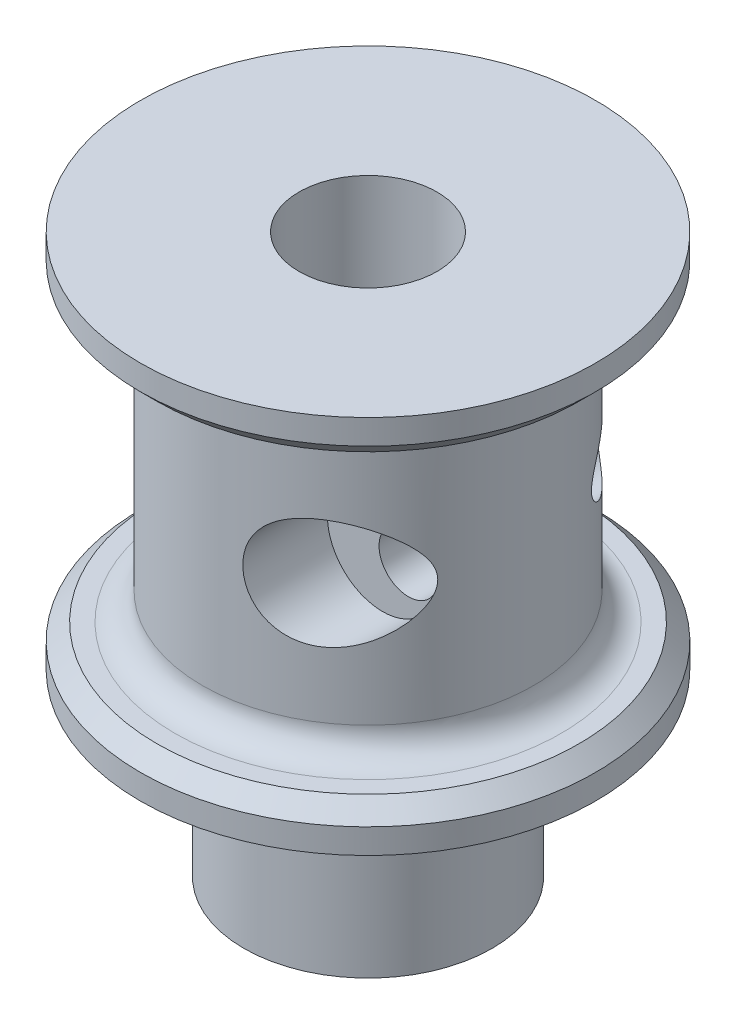
ISO-10303-21;
HEADER;
FILE_DESCRIPTION(('STEP AP214'),'2;1');
FILE_NAME('part.step','',(''),(''),'','','');
FILE_SCHEMA(('AUTOMOTIVE_DESIGN { 1 0 10303 214 1 1 1 1 }'));
ENDSEC;
DATA;
#1=APPLICATION_CONTEXT('core data for automotive mechanical design processes');
#2=APPLICATION_PROTOCOL_DEFINITION('international standard','automotive_design',2000,#1);
#3=PRODUCT_CONTEXT('',#1,'mechanical');
#4=PRODUCT('Part','Part','',(#3));
#5=PRODUCT_RELATED_PRODUCT_CATEGORY('part','',(#4));
#6=PRODUCT_DEFINITION_FORMATION('','',#4);
#7=PRODUCT_DEFINITION_CONTEXT('part definition',#1,'design');
#8=PRODUCT_DEFINITION('design','',#6,#7);
#9=PRODUCT_DEFINITION_SHAPE('','',#8);
#10=(LENGTH_UNIT() NAMED_UNIT(*) SI_UNIT(.MILLI.,.METRE.));
#11=(NAMED_UNIT(*) PLANE_ANGLE_UNIT() SI_UNIT($,.RADIAN.));
#12=(NAMED_UNIT(*) SI_UNIT($,.STERADIAN.) SOLID_ANGLE_UNIT());
#13=UNCERTAINTY_MEASURE_WITH_UNIT(LENGTH_MEASURE(1.E-05),#10,'distance_accuracy_value','');
#14=(GEOMETRIC_REPRESENTATION_CONTEXT(3) GLOBAL_UNCERTAINTY_ASSIGNED_CONTEXT((#13)) GLOBAL_UNIT_ASSIGNED_CONTEXT((#10,
#11,#12)) REPRESENTATION_CONTEXT('',''));
#15=CARTESIAN_POINT('',(0.,0.,0.));
#16=DIRECTION('',(0.,0.,1.));
#17=DIRECTION('',(1.,0.,0.));
#18=AXIS2_PLACEMENT_3D('',#15,#16,#17);
#19=CARTESIAN_POINT('',(0.,64.29375,0.));
#20=DIRECTION('',(0.,1.,0.));
#21=DIRECTION('',(0.,0.,1.));
#22=AXIS2_PLACEMENT_3D('',#19,#20,#21);
#23=CYLINDRICAL_SURFACE('',#22,19.05);
#24=CARTESIAN_POINT('',(0.,28.575,0.));
#25=DIRECTION('',(0.,-1.,0.));
#26=DIRECTION('',(0.,0.,-1.));
#27=AXIS2_PLACEMENT_3D('',#24,#25,#26);
#28=CIRCLE('',#27,19.05);
#29=CARTESIAN_POINT('',(0.,28.575,-19.05));
#30=VERTEX_POINT('',#29);
#31=EDGE_CURVE('E98',#30,#30,#28,.F.);
#32=ORIENTED_EDGE('',*,*,#31,.T.);
#33=EDGE_LOOP('',(#32));
#34=FACE_BOUND('',#33,.T.);
#35=CARTESIAN_POINT('',(0.,56.35625,0.));
#36=DIRECTION('',(0.,1.,0.));
#37=DIRECTION('',(0.,0.,1.));
#38=AXIS2_PLACEMENT_3D('',#35,#36,#37);
#39=CIRCLE('',#38,19.05);
#40=CARTESIAN_POINT('',(0.,56.35625,19.05));
#41=VERTEX_POINT('',#40);
#42=EDGE_CURVE('E95',#41,#41,#39,.F.);
#43=ORIENTED_EDGE('',*,*,#42,.T.);
#44=EDGE_LOOP('',(#43));
#45=FACE_BOUND('',#44,.T.);
#46=CARTESIAN_POINT('',(16.87195,42.465625,-8.84532663034554));
#47=CARTESIAN_POINT('',(16.8719465216361,42.5628249372381,-8.84533418626981));
#48=CARTESIAN_POINT('',(16.8677093521176,42.6600525129128,-8.85342965716035));
#49=CARTESIAN_POINT('',(16.8512362092056,42.8513541307299,-8.8847413356337));
#50=CARTESIAN_POINT('',(16.8389891828751,42.9454236261281,-8.90797843724561));
#51=CARTESIAN_POINT('',(16.803253060049,43.1537384219589,-8.97524311057987));
#52=CARTESIAN_POINT('',(16.7775812245768,43.2662938089759,-9.02326157613072));
#53=CARTESIAN_POINT('',(16.7175633506835,43.4814097097343,-9.13397636915276));
#54=CARTESIAN_POINT('',(16.6831969411713,43.5839459558198,-9.1967071415093));
#55=CARTESIAN_POINT('',(16.613644835805,43.7642058524494,-9.32167464136595));
#56=CARTESIAN_POINT('',(16.5794084983376,43.8433140114177,-9.38248626346868));
#57=CARTESIAN_POINT('',(16.5069598638681,43.9952965911593,-9.50936988179796));
#58=CARTESIAN_POINT('',(16.468744725659,44.0681664886704,-9.5754456290478));
#59=CARTESIAN_POINT('',(16.3888546750002,44.2083598835788,-9.7115489958235));
#60=CARTESIAN_POINT('',(16.3471731992896,44.2756723552871,-9.78158402785889));
#61=CARTESIAN_POINT('',(16.2607954732451,44.4051473347608,-9.92451601918506));
#62=CARTESIAN_POINT('',(16.2160981697433,44.467308026392,-9.99741397449423));
#63=CARTESIAN_POINT('',(16.0873568219779,44.6344568823733,-10.2041091493854));
#64=CARTESIAN_POINT('',(16.0002749338024,44.7342181332729,-10.3402600896236));
#65=CARTESIAN_POINT('',(15.8183218174806,44.9203193991438,-10.6165264217246));
#66=CARTESIAN_POINT('',(15.7234449777685,45.0066496134602,-10.7566446211991));
#67=CARTESIAN_POINT('',(15.5264084093469,45.1668598773862,-11.039150003444));
#68=CARTESIAN_POINT('',(15.424240116774,45.2407249324081,-11.1815396965424));
#69=CARTESIAN_POINT('',(15.2131683101731,45.3762184676025,-11.4670630170034));
#70=CARTESIAN_POINT('',(15.1042665401337,45.4378500989971,-11.6101964430132));
#71=CARTESIAN_POINT('',(14.8743632675527,45.5516276371218,-11.9034557336424));
#72=CARTESIAN_POINT('',(14.753028309409,45.6031352277091,-12.0535686854164));
#73=CARTESIAN_POINT('',(14.5036786862621,45.692047563634,-12.3524776100308));
#74=CARTESIAN_POINT('',(14.375662772275,45.7294496611649,-12.5012733304937));
#75=CARTESIAN_POINT('',(14.1137113791278,45.789160589946,-12.7962672753531));
#76=CARTESIAN_POINT('',(13.9797862121799,45.8114946865352,-12.942469445574));
#77=CARTESIAN_POINT('',(13.7066832042678,45.8399028347601,-13.2313612100489));
#78=CARTESIAN_POINT('',(13.5675074297327,45.8459832168858,-13.3740521503946));
#79=CARTESIAN_POINT('',(13.2214786455279,45.8390442951247,-13.7177897137062));
#80=CARTESIAN_POINT('',(13.0121828517401,45.8162723575563,-13.9164099442979));
#81=CARTESIAN_POINT('',(12.6956518392678,45.7499640148885,-14.2036399502211));
#82=CARTESIAN_POINT('',(12.5897233587205,45.7225081362489,-14.2975890892678));
#83=CARTESIAN_POINT('',(12.3778916826161,45.6561448845651,-14.4813650119207));
#84=CARTESIAN_POINT('',(12.2719884866214,45.6172400312108,-14.5711926975532));
#85=CARTESIAN_POINT('',(11.9998574550757,45.5009805071538,-14.7970509454557));
#86=CARTESIAN_POINT('',(11.8344335368793,45.4144305035841,-14.9295068717589));
#87=CARTESIAN_POINT('',(11.5126547664411,45.20859810758,-15.1790212855659));
#88=CARTESIAN_POINT('',(11.3562895585975,45.089354021439,-15.2960975567827));
#89=CARTESIAN_POINT('',(11.0850456013547,44.8401433818786,-15.4934685972486));
#90=CARTESIAN_POINT('',(10.9676015390035,44.7153027352788,-15.5766402895676));
#91=CARTESIAN_POINT('',(10.804181322348,44.5116130546891,-15.6900159212121));
#92=CARTESIAN_POINT('',(10.7518120516881,44.44094375616,-15.7259240686357));
#93=CARTESIAN_POINT('',(10.65198676232,44.294412188179,-15.7937110234648));
#94=CARTESIAN_POINT('',(10.6045286552496,44.2185521489589,-15.825591544812));
#95=CARTESIAN_POINT('',(10.5148920656911,44.0615165846766,-15.8852909500259));
#96=CARTESIAN_POINT('',(10.4727501345968,43.9803095462753,-15.9130819126753));
#97=CARTESIAN_POINT('',(10.3947720870703,43.8135988260272,-15.9641280707968));
#98=CARTESIAN_POINT('',(10.3589329818757,43.7280972055086,-15.9873854166532));
#99=CARTESIAN_POINT('',(10.2941240983516,43.5534238121014,-16.0291920587799));
#100=CARTESIAN_POINT('',(10.2651535716581,43.464252440293,-16.0477418679739));
#101=CARTESIAN_POINT('',(10.2145741455836,43.2829933957121,-16.0799837382553));
#102=CARTESIAN_POINT('',(10.1929643826478,43.1909060664223,-16.0936763691881));
#103=CARTESIAN_POINT('',(10.1594149216312,43.0147928130937,-16.1148731515233));
#104=CARTESIAN_POINT('',(10.1466793419063,42.9309788817346,-16.1228882543498));
#105=CARTESIAN_POINT('',(10.1275331279578,42.7623154073923,-16.1349217880104));
#106=CARTESIAN_POINT('',(10.1211246600631,42.6774655197695,-16.1389388499661));
#107=CARTESIAN_POINT('',(10.1147402584881,42.5074864646841,-16.1429410693307));
#108=CARTESIAN_POINT('',(10.1147596032331,42.4223575481495,-16.1429291862167));
#109=CARTESIAN_POINT('',(10.1212096112478,42.2524299339242,-16.1388853530222));
#110=CARTESIAN_POINT('',(10.1276426065808,42.1676313676113,-16.1348519406759));
#111=CARTESIAN_POINT('',(10.1554794057188,41.9233980902408,-16.1173593190421));
#112=CARTESIAN_POINT('',(10.1851326275399,41.7651689530766,-16.0986926292657));
#113=CARTESIAN_POINT('',(10.2657689978618,41.4567470690068,-16.0473899126782));
#114=CARTESIAN_POINT('',(10.3167518731244,41.3065542191821,-16.0147540648153));
#115=CARTESIAN_POINT('',(10.4389479692678,41.014404671499,-15.9353777891988));
#116=CARTESIAN_POINT('',(10.5105932886836,40.8727116054846,-15.8883346098704));
#117=CARTESIAN_POINT('',(10.6703009539847,40.6042265155821,-15.7815204437432));
#118=CARTESIAN_POINT('',(10.7583672533064,40.4774380920745,-15.7217463914266));
#119=CARTESIAN_POINT('',(10.955731385411,40.230027147831,-15.58493044184));
#120=CARTESIAN_POINT('',(11.066218693977,40.1109445775826,-15.5068282183549));
#121=CARTESIAN_POINT('',(11.2979595224625,39.8934568648519,-15.3388121993985));
#122=CARTESIAN_POINT('',(11.4192196466462,39.7950645326758,-15.2488911419821));
#123=CARTESIAN_POINT('',(11.7202752585022,39.5822872575235,-15.0195386233509));
#124=CARTESIAN_POINT('',(11.9034960843694,39.4781841811654,-14.8750367473259));
#125=CARTESIAN_POINT('',(12.2746758463006,39.3084244751125,-14.5702685273069));
#126=CARTESIAN_POINT('',(12.4626426171761,39.2428364341405,-14.4099746494669));
#127=CARTESIAN_POINT('',(12.7734070063865,39.1626463080341,-14.1340055546029));
#128=CARTESIAN_POINT('',(12.8967355817023,39.1383016427339,-14.0215846400365));
#129=CARTESIAN_POINT('',(13.1414594277856,39.1035716302142,-13.7924837539681));
#130=CARTESIAN_POINT('',(13.2628540855537,39.0931906253986,-13.6758024691621));
#131=CARTESIAN_POINT('',(13.502850132941,39.0853008545946,-13.4388997751098));
#132=CARTESIAN_POINT('',(13.6214474444919,39.0878098397898,-13.3186737107514));
#133=CARTESIAN_POINT('',(13.8549769801614,39.104753799575,-13.0755699957117));
#134=CARTESIAN_POINT('',(13.9699092357981,39.1191886715784,-12.952692367848));
#135=CARTESIAN_POINT('',(14.225496223059,39.1644429790262,-12.6721211735543));
#136=CARTESIAN_POINT('',(14.3649043165988,39.1985886413531,-12.5138235557884));
#137=CARTESIAN_POINT('',(14.6363305876669,39.2833348276302,-12.1952511749152));
#138=CARTESIAN_POINT('',(14.7683459414171,39.3339415895893,-12.0349756844707));
#139=CARTESIAN_POINT('',(15.0244138193233,39.4508087043639,-11.7137393511001));
#140=CARTESIAN_POINT('',(15.1484650028052,39.517071683978,-11.5527783976221));
#141=CARTESIAN_POINT('',(15.3880536035669,39.6649689879374,-11.2316687418407));
#142=CARTESIAN_POINT('',(15.5035949139057,39.7465962219757,-11.0715196997257));
#143=CARTESIAN_POINT('',(15.6858316591511,39.8935877746442,-10.8107666949455));
#144=CARTESIAN_POINT('',(15.7551969350105,39.9543016597317,-10.7093851624812));
#145=CARTESIAN_POINT('',(15.8899846363061,40.0825695909406,-10.5083546635872));
#146=CARTESIAN_POINT('',(15.9554078798866,40.1501222098708,-10.4087053407242));
#147=CARTESIAN_POINT('',(16.0819076073571,40.2924415099106,-10.2121679782273));
#148=CARTESIAN_POINT('',(16.1429921169525,40.3671942348956,-10.1152750501221));
#149=CARTESIAN_POINT('',(16.260482237279,40.5247287454101,-9.92530502625232));
#150=CARTESIAN_POINT('',(16.3168901827343,40.6075064792134,-9.83222603830212));
#151=CARTESIAN_POINT('',(16.4313476044249,40.7934427730511,-9.63988478941781));
#152=CARTESIAN_POINT('',(16.4886654424024,40.8978525889301,-9.54138032176987));
#153=CARTESIAN_POINT('',(16.5948878393044,41.1201388626404,-9.35540518135589));
#154=CARTESIAN_POINT('',(16.6437997296774,41.2380034347042,-9.26792491151947));
#155=CARTESIAN_POINT('',(16.7190192353771,41.455954723619,-9.13133698015377));
#156=CARTESIAN_POINT('',(16.747889660634,41.5525796889313,-9.07818561837451));
#157=CARTESIAN_POINT('',(16.7977803305776,41.7540634083485,-8.98553561533661));
#158=CARTESIAN_POINT('',(16.8188180265392,41.8589032207732,-8.94600663829486));
#159=CARTESIAN_POINT('',(16.8469702792428,42.047561134364,-8.89284893107602));
#160=CARTESIAN_POINT('',(16.8562689520402,42.1299052869696,-8.87518296958726));
#161=CARTESIAN_POINT('',(16.8687585285421,42.2967018477084,-8.85142193711176));
#162=CARTESIAN_POINT('',(16.8719530228868,42.3811529868178,-8.84532006383787));
#163=CARTESIAN_POINT('',(16.87195,42.465625,-8.84532663034554));
#164=B_SPLINE_CURVE_WITH_KNOTS('',3,(#46,#47,#48,#49,#50,#51,#52,#53,#54,#55,#56,#57,#58,#59,
#60,#61,#62,#63,#64,#65,#66,#67,#68,#69,#70,#71,#72,#73,#74,#75,#76,#77,#78,#79,#80,#81,#82,#83,
#84,#85,#86,#87,#88,#89,#90,#91,#92,#93,#94,#95,#96,#97,#98,#99,#100,#101,#102,#103,#104,#105,
#106,#107,#108,#109,#110,#111,#112,#113,#114,#115,#116,#117,#118,#119,#120,#121,#122,#123,#124,
#125,#126,#127,#128,#129,#130,#131,#132,#133,#134,#135,#136,#137,#138,#139,#140,#141,#142,#143,
#144,#145,#146,#147,#148,#149,#150,#151,#152,#153,#154,#155,#156,#157,#158,#159,#160,#161,#162,
#163),.UNSPECIFIED.,.T.,.F.,(4,2,2,2,2,2,2,2,2,2,2,2,2,2,2,2,2,2,2,2,2,2,2,2,2,2,2,2,2,2,2,2,2,
2,2,2,2,2,2,2,2,2,2,2,2,2,2,2,2,2,2,2,2,2,2,2,2,2,4),(0.,0.291250071262371,0.582902893810931,
0.955895250123374,1.32976974161812,1.6458007963426,1.96205909276198,2.27893046473695,
2.59591307099201,3.16482689726047,3.73415393344555,4.3041610167205,4.87402108010225,
5.47273560689547,6.07156246526517,6.66938272578152,7.26697011356522,8.13168293535657,
8.56393392036089,8.99608984663929,9.68004103514791,10.3631942660223,10.9321304646758,
11.2168485381084,11.5014450397385,11.7879024547183,12.0742236648768,12.3605136646455,
12.6467700656804,12.9019057981855,13.1571288559088,13.4121644389567,13.6672927891587,
14.1510224554962,14.6347459253278,15.1294267188311,15.6242267634445,16.1628378729712,
16.7017814866013,17.4641664732488,18.2279050524883,18.7332270929899,19.2387062416834,
19.7448816869871,20.2510527782074,20.8912437192485,21.531677546767,22.1722189026068,
22.8124653824945,23.2233384996657,23.6341260468488,24.044132792985,24.4539335993859,
24.9167479965324,25.379156667596,25.720111448149,26.0603019719624,26.3135630889469,
26.5666751850864),.UNSPECIFIED.);
#165=CARTESIAN_POINT('',(16.87195,42.465625,-8.84532663034554));
#166=VERTEX_POINT('',#165);
#167=EDGE_CURVE('E58',#166,#166,#164,.T.);
#168=ORIENTED_EDGE('',*,*,#167,.T.);
#169=EDGE_LOOP('',(#168));
#170=FACE_BOUND('',#169,.T.);
#171=CARTESIAN_POINT('',(4.17195,42.465625,18.5875585593563));
#172=CARTESIAN_POINT('',(4.17195021808428,42.2919228529711,18.5875586178116));
#173=CARTESIAN_POINT('',(4.17908239864553,42.1182167173892,18.5859620418283));
#174=CARTESIAN_POINT('',(4.20756066508708,41.7719536232744,18.5795356424714));
#175=CARTESIAN_POINT('',(4.22891341051034,41.599397241433,18.5747043042412));
#176=CARTESIAN_POINT('',(4.28566903104535,41.2567138427395,18.5616913992418));
#177=CARTESIAN_POINT('',(4.32107380419929,41.0865871572897,18.5535093798832));
#178=CARTESIAN_POINT('',(4.4056213837091,40.7500763398786,18.5336149505616));
#179=CARTESIAN_POINT('',(4.45475786574346,40.5836905230356,18.5219041656249));
#180=CARTESIAN_POINT('',(4.56639574739873,40.2556687981284,18.4946973462098));
#181=CARTESIAN_POINT('',(4.62890523617927,40.0940358326131,18.4791990198851));
#182=CARTESIAN_POINT('',(4.76670528265085,39.7768434134291,18.4441337520353));
#183=CARTESIAN_POINT('',(4.84199101236233,39.621281692726,18.4245683467819));
#184=CARTESIAN_POINT('',(5.00471208814968,39.3172409152068,18.3810350044571));
#185=CARTESIAN_POINT('',(5.09215045196683,39.1687636299368,18.3570659734003));
#186=CARTESIAN_POINT('',(5.27832964298539,38.8800371305056,18.3044007540702));
#187=CARTESIAN_POINT('',(5.37706624577975,38.7397848704857,18.2757063308682));
#188=CARTESIAN_POINT('',(5.58455582513596,38.4689220142496,18.2133720594647));
#189=CARTESIAN_POINT('',(5.69327009778455,38.3382774306236,18.1797510421073));
#190=CARTESIAN_POINT('',(5.91999331097417,38.0869104085435,18.1071903142523));
#191=CARTESIAN_POINT('',(6.03800218811788,37.9661879024236,18.0682506400312));
#192=CARTESIAN_POINT('',(6.28217165491967,37.735403277312,17.9848118717485));
#193=CARTESIAN_POINT('',(6.40833155558242,37.625340259248,17.9403132472816));
#194=CARTESIAN_POINT('',(6.66760021699704,37.416446543648,17.8455779429559));
#195=CARTESIAN_POINT('',(6.80070902416961,37.3176159211615,17.7953412247623));
#196=CARTESIAN_POINT('',(7.07356906970298,37.1309567933065,17.6886609222176));
#197=CARTESIAN_POINT('',(7.21336041629441,37.043210491918,17.6321761975283));
#198=CARTESIAN_POINT('',(7.49746343770359,36.8797632335889,17.5132596589294));
#199=CARTESIAN_POINT('',(7.64177698104534,36.8040673364333,17.4508253643811));
#200=CARTESIAN_POINT('',(7.93355623716911,36.664862769516,17.3201250848558));
#201=CARTESIAN_POINT('',(8.0810213425497,36.601351774481,17.2518602161415));
#202=CARTESIAN_POINT('',(8.37791397589429,36.486414832932,17.1096509291039));
#203=CARTESIAN_POINT('',(8.52734168348279,36.4349900008414,17.0357059878742));
#204=CARTESIAN_POINT('',(8.83598132608253,36.3412840309509,16.8777885942093));
#205=CARTESIAN_POINT('',(8.99524357642449,36.2997343807689,16.793480865165));
#206=CARTESIAN_POINT('',(9.31345026769507,36.2295541902694,16.6191175031538));
#207=CARTESIAN_POINT('',(9.47239470363205,36.2009238513018,16.5290617806283));
#208=CARTESIAN_POINT('',(9.78898001906057,36.1560427232328,16.3435627540579));
#209=CARTESIAN_POINT('',(9.9466201869439,36.1397983012962,16.2481167060768));
#210=CARTESIAN_POINT('',(10.2596184678381,36.1191068693275,16.0523154804189));
#211=CARTESIAN_POINT('',(10.4149761742182,36.1146619366781,15.9519594414707));
#212=CARTESIAN_POINT('',(10.7836851199541,36.11738462494,15.7060901191539));
#213=CARTESIAN_POINT('',(10.9955973391326,36.1298575845266,15.5584541086855));
#214=CARTESIAN_POINT('',(11.411875311752,36.1748065883899,15.2557499122182));
#215=CARTESIAN_POINT('',(11.6162385330652,36.2072892810124,15.1006792718204));
#216=CARTESIAN_POINT('',(12.0164461655695,36.2906106543418,14.784203428424));
#217=CARTESIAN_POINT('',(12.21228141012,36.3414685660332,14.6227917473973));
#218=CARTESIAN_POINT('',(12.5943985906113,36.4600045742915,14.2949990973338));
#219=CARTESIAN_POINT('',(12.7806812881039,36.5276813274976,14.1286185261074));
#220=CARTESIAN_POINT('',(13.1457305154086,36.679615153489,13.7896762463482));
#221=CARTESIAN_POINT('',(13.3243557087869,36.7640906229326,13.6170606606622));
#222=CARTESIAN_POINT('',(13.670935171061,36.9479371849234,13.2690746196905));
#223=CARTESIAN_POINT('',(13.8388887727297,37.0473092075556,13.0937039930029));
#224=CARTESIAN_POINT('',(14.1640053933669,37.2602691000942,12.741309425922));
#225=CARTESIAN_POINT('',(14.3211598785709,37.3738680168925,12.5642843007765));
#226=CARTESIAN_POINT('',(14.6243252622821,37.6147992067687,12.2100752260926));
#227=CARTESIAN_POINT('',(14.7703373206123,37.7421300471424,12.0328912950322));
#228=CARTESIAN_POINT('',(15.0416415370662,38.0015761853056,11.6916981123554));
#229=CARTESIAN_POINT('',(15.1676660852924,38.1328065017183,11.5275980822336));
#230=CARTESIAN_POINT('',(15.4095692179672,38.4076438936616,11.2021771301595));
#231=CARTESIAN_POINT('',(15.5254451923001,38.5512541344551,11.0408569316724));
#232=CARTESIAN_POINT('',(15.7462882730323,38.8512892885426,10.7235333963683));
#233=CARTESIAN_POINT('',(15.8512795229969,39.0076844016603,10.5675188314632));
#234=CARTESIAN_POINT('',(16.0497754492597,39.3347731519929,10.2635323119011));
#235=CARTESIAN_POINT('',(16.1432889606709,39.505455618952,10.1155542206288));
#236=CARTESIAN_POINT('',(16.3157934925468,39.8595007296541,9.83483370388366));
#237=CARTESIAN_POINT('',(16.3950377941567,40.0425410684003,9.70184555180777));
#238=CARTESIAN_POINT('',(16.5390120653331,40.426160740454,9.45431168401019));
#239=CARTESIAN_POINT('',(16.6037529226522,40.6267267589142,9.33975215223973));
#240=CARTESIAN_POINT('',(16.7053046904144,41.0094579433332,9.15665440072944));
#241=CARTESIAN_POINT('',(16.7450322738949,41.1885824133716,9.08355798703743));
#242=CARTESIAN_POINT('',(16.7933950596589,41.4654898248869,8.99363894141309));
#243=CARTESIAN_POINT('',(16.8076419190501,41.5591325705457,8.96695866009333));
#244=CARTESIAN_POINT('',(16.832073764772,41.7487175172679,8.92101296109328));
#245=CARTESIAN_POINT('',(16.8422609210818,41.8446584607536,8.90174358235469));
#246=CARTESIAN_POINT('',(16.8583828043913,42.0392905089333,8.87117437182557));
#247=CARTESIAN_POINT('',(16.8642680441446,42.1380004570572,8.85996730766856));
#248=CARTESIAN_POINT('',(16.8714049703018,42.3361962089688,8.84636958848451));
#249=CARTESIAN_POINT('',(16.8726568792638,42.4356819752607,8.84397850998903));
#250=CARTESIAN_POINT('',(16.8704839102348,42.6344326019546,8.84812282534869));
#251=CARTESIAN_POINT('',(16.8670581579707,42.7336974175864,8.85465988790835));
#252=CARTESIAN_POINT('',(16.8556447904075,42.9310072825564,8.87636675658284));
#253=CARTESIAN_POINT('',(16.8476567591393,43.0290522198382,8.89153734986544));
#254=CARTESIAN_POINT('',(16.8269406042575,43.2271508859073,8.93068172862657));
#255=CARTESIAN_POINT('',(16.8140283872768,43.3271174039877,8.95499682269875));
#256=CARTESIAN_POINT('',(16.7838881687964,43.5242024722494,9.01136071311965));
#257=CARTESIAN_POINT('',(16.7666574268923,43.6213191701415,9.04341441968009));
#258=CARTESIAN_POINT('',(16.7090422604307,43.9079790579143,9.14969170889579));
#259=CARTESIAN_POINT('',(16.6627546685059,44.0926541937481,9.23399310420039));
#260=CARTESIAN_POINT('',(16.5674092992079,44.4143684967327,9.40378038738493));
#261=CARTESIAN_POINT('',(16.5205096919167,44.5538345689291,9.48606178215591));
#262=CARTESIAN_POINT('',(16.4194523564153,44.8241791673278,9.65992736120788));
#263=CARTESIAN_POINT('',(16.3652898641974,44.9550519722175,9.75151764192116));
#264=CARTESIAN_POINT('',(16.2504606594259,45.2090056482049,9.94169991775759));
#265=CARTESIAN_POINT('',(16.1897805234019,45.3320695744885,10.04030621622));
#266=CARTESIAN_POINT('',(16.062574772822,45.5708242418765,10.2425825789754));
#267=CARTESIAN_POINT('',(15.9960471136651,45.6865123794278,10.346254408772));
#268=CARTESIAN_POINT('',(15.8054679034129,45.9955628813659,10.6366563180877));
#269=CARTESIAN_POINT('',(15.6757883372081,46.1818953781481,10.8272051585087));
#270=CARTESIAN_POINT('',(15.4010584982236,46.5358800182006,11.2145640756028));
#271=CARTESIAN_POINT('',(15.2559979201413,46.7035194808385,11.4113782875088));
#272=CARTESIAN_POINT('',(14.9510421923343,47.0212999479216,11.8081119680076));
#273=CARTESIAN_POINT('',(14.7911301646483,47.171420595046,12.0080347491966));
#274=CARTESIAN_POINT('',(14.4570494197612,47.4541471484267,12.4082301369689));
#275=CARTESIAN_POINT('',(14.282884155963,47.5867572770589,12.6085026473756));
#276=CARTESIAN_POINT('',(13.9133938132116,47.8389466706179,13.0153148112857));
#277=CARTESIAN_POINT('',(13.7175052878822,47.9578062916972,13.2217903455734));
#278=CARTESIAN_POINT('',(13.3109169683933,48.1750281214237,13.6310380034154));
#279=CARTESIAN_POINT('',(13.1002145754108,48.273386721481,13.8338094692583));
#280=CARTESIAN_POINT('',(12.6650833361009,48.4476216315907,14.233242814907));
#281=CARTESIAN_POINT('',(12.4406850523328,48.5235459395417,14.4299169204633));
#282=CARTESIAN_POINT('',(11.9787673842027,48.6508917903853,14.8156014162293));
#283=CARTESIAN_POINT('',(11.7412535361548,48.7023235850965,15.0046149825438));
#284=CARTESIAN_POINT('',(11.3232158054002,48.7673515371873,15.3210768519095));
#285=CARTESIAN_POINT('',(11.1454745995889,48.7875233435057,15.4508754492831));
#286=CARTESIAN_POINT('',(10.7848849673285,48.8127514589133,15.7046911365605));
#287=CARTESIAN_POINT('',(10.6020378341332,48.8178115611393,15.8287096696031));
#288=CARTESIAN_POINT('',(10.2323312826695,48.8117098508451,16.070178453752));
#289=CARTESIAN_POINT('',(10.0454724485868,48.8005503846505,16.1876296523376));
#290=CARTESIAN_POINT('',(9.66910786527541,48.7609375059362,16.4152126017937));
#291=CARTESIAN_POINT('',(9.47960204905563,48.7324836549443,16.5253441670077));
#292=CARTESIAN_POINT('',(9.0979648025979,48.6569846644187,16.7385102928113));
#293=CARTESIAN_POINT('',(8.90582506905804,48.6097750353334,16.8414723243996));
#294=CARTESIAN_POINT('',(8.52270500350742,48.4960016613582,17.0385562988116));
#295=CARTESIAN_POINT('',(8.33172469586163,48.4294375111665,17.1326780564572));
#296=CARTESIAN_POINT('',(7.95345833793192,48.2765571934997,17.3115204909208));
#297=CARTESIAN_POINT('',(7.76616979903412,48.1902548631301,17.3962476921358));
#298=CARTESIAN_POINT('',(7.39777751306119,47.997822238573,17.5560727161595));
#299=CARTESIAN_POINT('',(7.21667264736109,47.891695553325,17.6311722874479));
#300=CARTESIAN_POINT('',(6.88856198344539,47.6765570387836,17.7616670903477));
#301=CARTESIAN_POINT('',(6.74037604061158,47.5701140464477,17.8183450623737));
#302=CARTESIAN_POINT('',(6.45223299395201,47.3434818791713,17.9246971538579));
#303=CARTESIAN_POINT('',(6.31227512404735,47.2232939870353,17.9743719259567));
#304=CARTESIAN_POINT('',(6.04225574534459,46.969967895516,18.0669316990836));
#305=CARTESIAN_POINT('',(5.91219151618288,46.8368332790816,18.1098185700492));
#306=CARTESIAN_POINT('',(5.66343341964469,46.5585627091262,18.1891470811771));
#307=CARTESIAN_POINT('',(5.54473905926743,46.4134272764729,18.2255890008522));
#308=CARTESIAN_POINT('',(5.32938975619593,46.124792828952,18.2896600785022));
#309=CARTESIAN_POINT('',(5.2317237685195,45.9821526942653,18.3177690125447));
#310=CARTESIAN_POINT('',(5.04802493790769,45.6887595323887,18.3692418569664));
#311=CARTESIAN_POINT('',(4.9619916233883,45.5380068344256,18.3926059597185));
#312=CARTESIAN_POINT('',(4.80236931497768,45.2295089715153,18.4349279716158));
#313=CARTESIAN_POINT('',(4.72877731039879,45.0717655099667,18.45388694718));
#314=CARTESIAN_POINT('',(4.5946702608713,44.7503939009652,18.4877335558128));
#315=CARTESIAN_POINT('',(4.53415498651971,44.5867658568034,18.5026212603042));
#316=CARTESIAN_POINT('',(4.42955029696947,44.2635374854015,18.5279336385009));
#317=CARTESIAN_POINT('',(4.38476517886082,44.1041768863917,18.5385516275481));
#318=CARTESIAN_POINT('',(4.30773506074841,43.7822252180973,18.5566022282858));
#319=CARTESIAN_POINT('',(4.27549371764387,43.6196332212587,18.5640339111336));
#320=CARTESIAN_POINT('',(4.22382095534039,43.2923689024754,18.5758590628843));
#321=CARTESIAN_POINT('',(4.20438560819108,43.1276972342321,18.5802534634253));
#322=CARTESIAN_POINT('',(4.17844761949334,42.7972268529961,18.5861037306606));
#323=CARTESIAN_POINT('',(4.17194979183348,42.6314277435127,18.5875585035593));
#324=CARTESIAN_POINT('',(4.17195,42.465625,18.5875585593563));
#325=B_SPLINE_CURVE_WITH_KNOTS('',3,(#171,#172,#173,#174,#175,#176,#177,#178,#179,#180,#181,
#182,#183,#184,#185,#186,#187,#188,#189,#190,#191,#192,#193,#194,#195,#196,#197,#198,#199,#200,
#201,#202,#203,#204,#205,#206,#207,#208,#209,#210,#211,#212,#213,#214,#215,#216,#217,#218,#219,
#220,#221,#222,#223,#224,#225,#226,#227,#228,#229,#230,#231,#232,#233,#234,#235,#236,#237,#238,
#239,#240,#241,#242,#243,#244,#245,#246,#247,#248,#249,#250,#251,#252,#253,#254,#255,#256,#257,
#258,#259,#260,#261,#262,#263,#264,#265,#266,#267,#268,#269,#270,#271,#272,#273,#274,#275,#276,
#277,#278,#279,#280,#281,#282,#283,#284,#285,#286,#287,#288,#289,#290,#291,#292,#293,#294,#295,
#296,#297,#298,#299,#300,#301,#302,#303,#304,#305,#306,#307,#308,#309,#310,#311,#312,#313,#314,
#315,#316,#317,#318,#319,#320,#321,#322,#323,#324),.UNSPECIFIED.,.T.,.F.,(4,2,2,2,2,2,2,2,2,2,2,
2,2,2,2,2,2,2,2,2,2,2,2,2,2,2,2,2,2,2,2,2,2,2,2,2,2,2,2,2,2,2,2,2,2,2,2,2,2,2,2,2,2,2,2,2,2,2,2,
2,2,2,2,2,2,2,2,2,2,2,2,2,2,2,2,2,4),(0.,0.520959900232386,1.0421639396197,1.56343840329914,
2.08447318162262,2.60582402281725,3.12697828905224,3.64826220026872,4.16935183661605,
4.68849930478861,5.20764323222921,5.72674333438159,6.24584690471628,6.76859871740579,
7.29156945012906,7.81444028364393,8.33735931037585,8.89157615540502,9.44580163771291,
10.0003118361417,10.5549196535068,11.3295087276719,12.1043553023031,12.8800151696309,
13.6556131030634,14.4420449489923,15.2285259172468,16.0156214028076,16.8026348469775,
17.5371770140747,18.271907546963,19.0049718314045,19.737468244864,20.4552986441351,
21.1725883479223,21.7627255004251,22.0576140720095,22.3523448086283,22.6504148121542,
22.9484704979525,23.2465818991498,23.5447204852026,23.8553150059124,24.1661071216904,
24.7882333793189,25.2933571488938,25.7988138844311,26.3053323580909,26.8120286471287,
27.6998593234591,28.5882886522058,29.4777402902092,30.36697705826,31.2912637341983,
32.215712965938,33.1381697856436,34.0602401529625,34.7226970036948,35.3849875594421,
36.0471823176637,36.7093938655016,37.3775460045361,38.0457121363087,38.713411289916,
39.3809890099779,39.9533831412515,40.5257238948037,41.0979067039118,41.6700646917682,
42.1948645987534,42.7196432241728,43.2442946754334,43.7689369220705,44.2660281299065,
44.763264146841,45.2603475767584,45.7576159306394),.UNSPECIFIED.);
#326=CARTESIAN_POINT('',(16.87195,42.465625,8.84532663034554));
#327=VERTEX_POINT('',#326);
#328=EDGE_CURVE('E54',#327,#327,#325,.T.);
#329=ORIENTED_EDGE('',*,*,#328,.F.);
#330=EDGE_LOOP('',(#329));
#331=FACE_BOUND('',#330,.T.);
#332=ADVANCED_FACE('F37',(#34,#45,#170,#331),#23,.T.);
#333=CARTESIAN_POINT('',(13.49375,42.465625,-26.19375));
#334=DIRECTION('',(0.,0.,1.));
#335=DIRECTION('',(1.,0.,0.));
#336=AXIS2_PLACEMENT_3D('',#333,#334,#335);
#337=CYLINDRICAL_SURFACE('',#336,3.3782);
#338=ORIENTED_EDGE('',*,*,#167,.F.);
#339=EDGE_LOOP('',(#338));
#340=FACE_BOUND('',#339,.T.);
#341=CARTESIAN_POINT('',(13.49375,42.465625,8.84532663034554));
#342=DIRECTION('',(0.,0.,1.));
#343=DIRECTION('',(1.,0.,0.));
#344=AXIS2_PLACEMENT_3D('',#341,#342,#343);
#345=CIRCLE('',#344,3.3782);
#346=EDGE_CURVE('E12',#327,#327,#345,.F.);
#347=ORIENTED_EDGE('',*,*,#346,.F.);
#348=EDGE_LOOP('',(#347));
#349=FACE_BOUND('',#348,.T.);
#350=ADVANCED_FACE('F48',(#340,#349),#337,.F.);
#351=CARTESIAN_POINT('',(0.,64.29375,0.));
#352=DIRECTION('',(0.,1.,0.));
#353=DIRECTION('',(0.,0.,1.));
#354=AXIS2_PLACEMENT_3D('',#351,#352,#353);
#355=CYLINDRICAL_SURFACE('',#354,1.89864999999999);
#356=CARTESIAN_POINT('',(0.,0.,0.));
#357=DIRECTION('',(0.,1.,0.));
#358=DIRECTION('',(0.,0.,1.));
#359=AXIS2_PLACEMENT_3D('',#356,#357,#358);
#360=CIRCLE('',#359,1.89864999999998);
#361=CARTESIAN_POINT('',(0.,0.,1.89864999999998));
#362=VERTEX_POINT('',#361);
#363=EDGE_CURVE('E91',#362,#362,#360,.T.);
#364=ORIENTED_EDGE('',*,*,#363,.F.);
#365=EDGE_LOOP('',(#364));
#366=FACE_BOUND('',#365,.T.);
#367=CARTESIAN_POINT('',(0.,7.62,0.));
#368=DIRECTION('',(0.,1.,0.));
#369=DIRECTION('',(0.,0.,1.));
#370=AXIS2_PLACEMENT_3D('',#367,#368,#369);
#371=CIRCLE('',#370,1.89864999999999);
#372=CARTESIAN_POINT('',(0.,7.62,1.89864999999999));
#373=VERTEX_POINT('',#372);
#374=EDGE_CURVE('E88',#373,#373,#371,.F.);
#375=ORIENTED_EDGE('',*,*,#374,.F.);
#376=EDGE_LOOP('',(#375));
#377=FACE_BOUND('',#376,.T.);
#378=ADVANCED_FACE('F80',(#366,#377),#355,.F.);
#379=CARTESIAN_POINT('',(0.,0.,0.));
#380=DIRECTION('',(0.,1.,0.));
#381=DIRECTION('',(0.,0.,1.));
#382=AXIS2_PLACEMENT_3D('',#379,#380,#381);
#383=PLANE('',#382);
#384=ORIENTED_EDGE('',*,*,#363,.T.);
#385=EDGE_LOOP('',(#384));
#386=FACE_BOUND('',#385,.T.);
#387=CARTESIAN_POINT('',(0.,0.,0.));
#388=DIRECTION('',(0.,1.,0.));
#389=DIRECTION('',(0.,0.,1.));
#390=AXIS2_PLACEMENT_3D('',#387,#388,#389);
#391=CIRCLE('',#390,14.2875);
#392=CARTESIAN_POINT('',(0.,0.,14.2875));
#393=VERTEX_POINT('',#392);
#394=EDGE_CURVE('E116',#393,#393,#391,.T.);
#395=ORIENTED_EDGE('',*,*,#394,.F.);
#396=EDGE_LOOP('',(#395));
#397=FACE_BOUND('',#396,.T.);
#398=ADVANCED_FACE('F181',(#386,#397),#383,.F.);
#399=CARTESIAN_POINT('',(0.,64.29375,0.));
#400=DIRECTION('',(0.,1.,0.));
#401=DIRECTION('',(0.,0.,1.));
#402=AXIS2_PLACEMENT_3D('',#399,#400,#401);
#403=CYLINDRICAL_SURFACE('',#402,14.2875);
#404=CARTESIAN_POINT('',(0.,20.6375,0.));
#405=DIRECTION('',(0.,1.,0.));
#406=DIRECTION('',(0.,0.,1.));
#407=AXIS2_PLACEMENT_3D('',#404,#405,#406);
#408=CIRCLE('',#407,14.2875);
#409=CARTESIAN_POINT('',(0.,20.6375,14.2875));
#410=VERTEX_POINT('',#409);
#411=EDGE_CURVE('E119',#410,#410,#408,.T.);
#412=ORIENTED_EDGE('',*,*,#411,.F.);
#413=EDGE_LOOP('',(#412));
#414=FACE_BOUND('',#413,.T.);
#415=ORIENTED_EDGE('',*,*,#394,.T.);
#416=EDGE_LOOP('',(#415));
#417=FACE_BOUND('',#416,.T.);
#418=ADVANCED_FACE('F184',(#414,#417),#403,.T.);
#419=CARTESIAN_POINT('',(14.2875,20.6375,0.));
#420=DIRECTION('',(0.,1.,0.));
#421=DIRECTION('',(0.,0.,1.));
#422=AXIS2_PLACEMENT_3D('',#419,#420,#421);
#423=PLANE('',#422);
#424=CARTESIAN_POINT('',(0.,20.6375,0.));
#425=DIRECTION('',(0.,1.,0.));
#426=DIRECTION('',(0.,0.,1.));
#427=AXIS2_PLACEMENT_3D('',#424,#425,#426);
#428=CIRCLE('',#427,26.19375);
#429=CARTESIAN_POINT('',(0.,20.6375,26.19375));
#430=VERTEX_POINT('',#429);
#431=EDGE_CURVE('E122',#430,#430,#428,.T.);
#432=ORIENTED_EDGE('',*,*,#431,.F.);
#433=EDGE_LOOP('',(#432));
#434=FACE_BOUND('',#433,.T.);
#435=ORIENTED_EDGE('',*,*,#411,.T.);
#436=EDGE_LOOP('',(#435));
#437=FACE_BOUND('',#436,.T.);
#438=ADVANCED_FACE('F188',(#434,#437),#423,.F.);
#439=CARTESIAN_POINT('',(0.,64.29375,0.));
#440=DIRECTION('',(0.,1.,0.));
#441=DIRECTION('',(0.,0.,1.));
#442=AXIS2_PLACEMENT_3D('',#439,#440,#441);
#443=CYLINDRICAL_SURFACE('',#442,26.19375);
#444=CARTESIAN_POINT('',(0.,23.495,0.));
#445=DIRECTION('',(0.,-1.,0.));
#446=DIRECTION('',(0.,0.,-1.));
#447=AXIS2_PLACEMENT_3D('',#444,#445,#446);
#448=CIRCLE('',#447,26.19375);
#449=CARTESIAN_POINT('',(0.,23.495,-26.19375));
#450=VERTEX_POINT('',#449);
#451=EDGE_CURVE('E110',#450,#450,#448,.T.);
#452=ORIENTED_EDGE('',*,*,#451,.T.);
#453=EDGE_LOOP('',(#452));
#454=FACE_BOUND('',#453,.T.);
#455=ORIENTED_EDGE('',*,*,#431,.T.);
#456=EDGE_LOOP('',(#455));
#457=FACE_BOUND('',#456,.T.);
#458=ADVANCED_FACE('F192',(#454,#457),#443,.T.);
#459=CARTESIAN_POINT('',(26.19375,25.4,0.));
#460=DIRECTION('',(0.,-1.,0.));
#461=DIRECTION('',(0.,0.,-1.));
#462=AXIS2_PLACEMENT_3D('',#459,#460,#461);
#463=PLANE('',#462);
#464=CARTESIAN_POINT('',(0.,25.4,0.));
#465=DIRECTION('',(0.,-1.,0.));
#466=DIRECTION('',(0.,0.,-1.));
#467=AXIS2_PLACEMENT_3D('',#464,#465,#466);
#468=CIRCLE('',#467,22.225);
#469=CARTESIAN_POINT('',(0.,25.4,-22.225));
#470=VERTEX_POINT('',#469);
#471=EDGE_CURVE('E44',#470,#470,#468,.T.);
#472=ORIENTED_EDGE('',*,*,#471,.T.);
#473=EDGE_LOOP('',(#472));
#474=FACE_BOUND('',#473,.T.);
#475=CARTESIAN_POINT('',(0.,25.4,0.));
#476=DIRECTION('',(0.,-1.,0.));
#477=DIRECTION('',(0.,0.,-1.));
#478=AXIS2_PLACEMENT_3D('',#475,#476,#477);
#479=CIRCLE('',#478,24.28875);
#480=CARTESIAN_POINT('',(0.,25.4,-24.28875));
#481=VERTEX_POINT('',#480);
#482=EDGE_CURVE('E113',#481,#481,#479,.F.);
#483=ORIENTED_EDGE('',*,*,#482,.T.);
#484=EDGE_LOOP('',(#483));
#485=FACE_BOUND('',#484,.T.);
#486=ADVANCED_FACE('F151',(#474,#485),#463,.F.);
#487=CARTESIAN_POINT('',(19.05,59.53125,0.));
#488=DIRECTION('',(0.,1.,0.));
#489=DIRECTION('',(0.,0.,1.));
#490=AXIS2_PLACEMENT_3D('',#487,#488,#489);
#491=PLANE('',#490);
#492=CARTESIAN_POINT('',(0.,59.53125,0.));
#493=DIRECTION('',(0.,1.,0.));
#494=DIRECTION('',(0.,0.,1.));
#495=AXIS2_PLACEMENT_3D('',#492,#493,#494);
#496=CIRCLE('',#495,22.225);
#497=CARTESIAN_POINT('',(0.,59.53125,22.225));
#498=VERTEX_POINT('',#497);
#499=EDGE_CURVE('E101',#498,#498,#496,.T.);
#500=ORIENTED_EDGE('',*,*,#499,.T.);
#501=EDGE_LOOP('',(#500));
#502=FACE_BOUND('',#501,.T.);
#503=CARTESIAN_POINT('',(0.,59.53125,0.));
#504=DIRECTION('',(0.,1.,0.));
#505=DIRECTION('',(0.,0.,1.));
#506=AXIS2_PLACEMENT_3D('',#503,#504,#505);
#507=CIRCLE('',#506,24.28875);
#508=CARTESIAN_POINT('',(0.,59.53125,24.28875));
#509=VERTEX_POINT('',#508);
#510=EDGE_CURVE('E104',#509,#509,#507,.F.);
#511=ORIENTED_EDGE('',*,*,#510,.T.);
#512=EDGE_LOOP('',(#511));
#513=FACE_BOUND('',#512,.T.);
#514=ADVANCED_FACE('F145',(#502,#513),#491,.F.);
#515=CARTESIAN_POINT('',(0.,64.29375,0.));
#516=DIRECTION('',(0.,1.,0.));
#517=DIRECTION('',(0.,0.,1.));
#518=AXIS2_PLACEMENT_3D('',#515,#516,#517);
#519=CYLINDRICAL_SURFACE('',#518,26.19375);
#520=CARTESIAN_POINT('',(0.,61.43625,0.));
#521=DIRECTION('',(0.,1.,0.));
#522=DIRECTION('',(0.,0.,1.));
#523=AXIS2_PLACEMENT_3D('',#520,#521,#522);
#524=CIRCLE('',#523,26.19375);
#525=CARTESIAN_POINT('',(0.,61.43625,26.19375));
#526=VERTEX_POINT('',#525);
#527=EDGE_CURVE('E107',#526,#526,#524,.T.);
#528=ORIENTED_EDGE('',*,*,#527,.T.);
#529=EDGE_LOOP('',(#528));
#530=FACE_BOUND('',#529,.T.);
#531=CARTESIAN_POINT('',(0.,64.29375,0.));
#532=DIRECTION('',(0.,1.,0.));
#533=DIRECTION('',(0.,0.,1.));
#534=AXIS2_PLACEMENT_3D('',#531,#532,#533);
#535=CIRCLE('',#534,26.19375);
#536=CARTESIAN_POINT('',(0.,64.29375,26.19375));
#537=VERTEX_POINT('',#536);
#538=EDGE_CURVE('E125',#537,#537,#535,.T.);
#539=ORIENTED_EDGE('',*,*,#538,.F.);
#540=EDGE_LOOP('',(#539));
#541=FACE_BOUND('',#540,.T.);
#542=ADVANCED_FACE('F140',(#530,#541),#519,.T.);
#543=CARTESIAN_POINT('',(26.19375,64.29375,0.));
#544=DIRECTION('',(0.,-1.,0.));
#545=DIRECTION('',(0.,0.,-1.));
#546=AXIS2_PLACEMENT_3D('',#543,#544,#545);
#547=PLANE('',#546);
#548=CARTESIAN_POINT('',(0.,64.29375,0.));
#549=DIRECTION('',(0.,1.,0.));
#550=DIRECTION('',(0.,0.,1.));
#551=AXIS2_PLACEMENT_3D('',#548,#549,#550);
#552=CIRCLE('',#551,7.9375);
#553=CARTESIAN_POINT('',(0.,64.29375,7.9375));
#554=VERTEX_POINT('',#553);
#555=EDGE_CURVE('E67',#554,#554,#552,.T.);
#556=ORIENTED_EDGE('',*,*,#555,.F.);
#557=EDGE_LOOP('',(#556));
#558=FACE_BOUND('',#557,.T.);
#559=ORIENTED_EDGE('',*,*,#538,.T.);
#560=EDGE_LOOP('',(#559));
#561=FACE_BOUND('',#560,.T.);
#562=ADVANCED_FACE('F136',(#558,#561),#547,.F.);
#563=CARTESIAN_POINT('',(0.,25.4,0.));
#564=DIRECTION('',(0.,-1.,0.));
#565=DIRECTION('',(0.,0.,-1.));
#566=AXIS2_PLACEMENT_3D('',#563,#564,#565);
#567=CONICAL_SURFACE('',#566,24.28875,0.785398163397447);
#568=ORIENTED_EDGE('',*,*,#451,.F.);
#569=EDGE_LOOP('',(#568));
#570=FACE_BOUND('',#569,.T.);
#571=ORIENTED_EDGE('',*,*,#482,.F.);
#572=EDGE_LOOP('',(#571));
#573=FACE_BOUND('',#572,.T.);
#574=ADVANCED_FACE('F139',(#570,#573),#567,.T.);
#575=CARTESIAN_POINT('',(0.,61.43625,0.));
#576=DIRECTION('',(0.,1.,0.));
#577=DIRECTION('',(0.,0.,1.));
#578=AXIS2_PLACEMENT_3D('',#575,#576,#577);
#579=CONICAL_SURFACE('',#578,26.19375,0.785398163397451);
#580=ORIENTED_EDGE('',*,*,#510,.F.);
#581=EDGE_LOOP('',(#580));
#582=FACE_BOUND('',#581,.T.);
#583=ORIENTED_EDGE('',*,*,#527,.F.);
#584=EDGE_LOOP('',(#583));
#585=FACE_BOUND('',#584,.T.);
#586=ADVANCED_FACE('F166',(#582,#585),#579,.T.);
#587=CARTESIAN_POINT('',(0.,56.35625,0.));
#588=DIRECTION('',(0.,1.,0.));
#589=DIRECTION('',(0.,0.,1.));
#590=AXIS2_PLACEMENT_3D('',#587,#588,#589);
#591=TOROIDAL_SURFACE('',#590,22.225,3.175);
#592=ORIENTED_EDGE('',*,*,#42,.F.);
#593=EDGE_LOOP('',(#592));
#594=FACE_BOUND('',#593,.T.);
#595=ORIENTED_EDGE('',*,*,#499,.F.);
#596=EDGE_LOOP('',(#595));
#597=FACE_BOUND('',#596,.T.);
#598=ADVANCED_FACE('F163',(#594,#597),#591,.F.);
#599=CARTESIAN_POINT('',(0.,28.575,0.));
#600=DIRECTION('',(0.,-1.,0.));
#601=DIRECTION('',(0.,0.,-1.));
#602=AXIS2_PLACEMENT_3D('',#599,#600,#601);
#603=TOROIDAL_SURFACE('',#602,22.225,3.175);
#604=ORIENTED_EDGE('',*,*,#471,.F.);
#605=EDGE_LOOP('',(#604));
#606=FACE_BOUND('',#605,.T.);
#607=ORIENTED_EDGE('',*,*,#31,.F.);
#608=EDGE_LOOP('',(#607));
#609=FACE_BOUND('',#608,.T.);
#610=ADVANCED_FACE('F39',(#606,#609),#603,.F.);
#611=CARTESIAN_POINT('',(0.,7.62,0.));
#612=DIRECTION('',(0.,1.,0.));
#613=DIRECTION('',(0.,0.,1.));
#614=AXIS2_PLACEMENT_3D('',#611,#612,#613);
#615=PLANE('',#614);
#616=CARTESIAN_POINT('',(0.,7.62,0.));
#617=DIRECTION('',(0.,1.,0.));
#618=DIRECTION('',(0.,0.,1.));
#619=AXIS2_PLACEMENT_3D('',#616,#617,#618);
#620=CIRCLE('',#619,7.9375);
#621=CARTESIAN_POINT('',(0.,7.62,7.9375));
#622=VERTEX_POINT('',#621);
#623=EDGE_CURVE('E92',#622,#622,#620,.F.);
#624=ORIENTED_EDGE('',*,*,#623,.F.);
#625=EDGE_LOOP('',(#624));
#626=FACE_BOUND('',#625,.T.);
#627=ORIENTED_EDGE('',*,*,#374,.T.);
#628=EDGE_LOOP('',(#627));
#629=FACE_BOUND('',#628,.T.);
#630=ADVANCED_FACE('F82',(#626,#629),#615,.T.);
#631=CARTESIAN_POINT('',(0.,-22.4506403026729,0.));
#632=DIRECTION('',(0.,1.,0.));
#633=DIRECTION('',(0.,0.,1.));
#634=AXIS2_PLACEMENT_3D('',#631,#632,#633);
#635=CYLINDRICAL_SURFACE('',#634,7.9375);
#636=ORIENTED_EDGE('',*,*,#623,.T.);
#637=EDGE_LOOP('',(#636));
#638=FACE_BOUND('',#637,.T.);
#639=ORIENTED_EDGE('',*,*,#555,.T.);
#640=EDGE_LOOP('',(#639));
#641=FACE_BOUND('',#640,.T.);
#642=ADVANCED_FACE('F76',(#638,#641),#635,.F.);
#643=CARTESIAN_POINT('',(10.52195,42.465625,26.19375));
#644=DIRECTION('',(0.,0.,-1.));
#645=DIRECTION('',(-1.,0.,0.));
#646=AXIS2_PLACEMENT_3D('',#643,#644,#645);
#647=CYLINDRICAL_SURFACE('',#646,6.35);
#648=CARTESIAN_POINT('',(10.52195,42.465625,8.84532663034554));
#649=DIRECTION('',(0.,0.,1.));
#650=DIRECTION('',(1.,0.,0.));
#651=AXIS2_PLACEMENT_3D('',#648,#649,#650);
#652=CIRCLE('',#651,6.35);
#653=EDGE_CURVE('E56',#327,#327,#652,.T.);
#654=ORIENTED_EDGE('',*,*,#653,.F.);
#655=ORIENTED_EDGE('',*,*,#328,.T.);
#656=EDGE_LOOP('',(#654,#655));
#657=FACE_BOUND('',#656,.T.);
#658=ADVANCED_FACE('F55',(#657),#647,.F.);
#659=CARTESIAN_POINT('',(10.52195,42.465625,8.84532663034554));
#660=DIRECTION('',(0.,0.,1.));
#661=DIRECTION('',(1.,0.,0.));
#662=AXIS2_PLACEMENT_3D('',#659,#660,#661);
#663=PLANE('',#662);
#664=ORIENTED_EDGE('',*,*,#653,.T.);
#665=ORIENTED_EDGE('',*,*,#346,.T.);
#666=EDGE_LOOP('',(#664,#665));
#667=FACE_BOUND('',#666,.T.);
#668=ADVANCED_FACE('F60',(#667),#663,.T.);
#669=CLOSED_SHELL('',(#332,#350,#378,#398,#418,#438,#458,#486,#514,#542,#562,#574,#586,#598,
#610,#630,#642,#658,#668));
#670=MANIFOLD_SOLID_BREP('B2',#669);
#671=ADVANCED_BREP_SHAPE_REPRESENTATION('',(#18,#670),#14);
#672=SHAPE_DEFINITION_REPRESENTATION(#9,#671);
ENDSEC;
END-ISO-10303-21;
